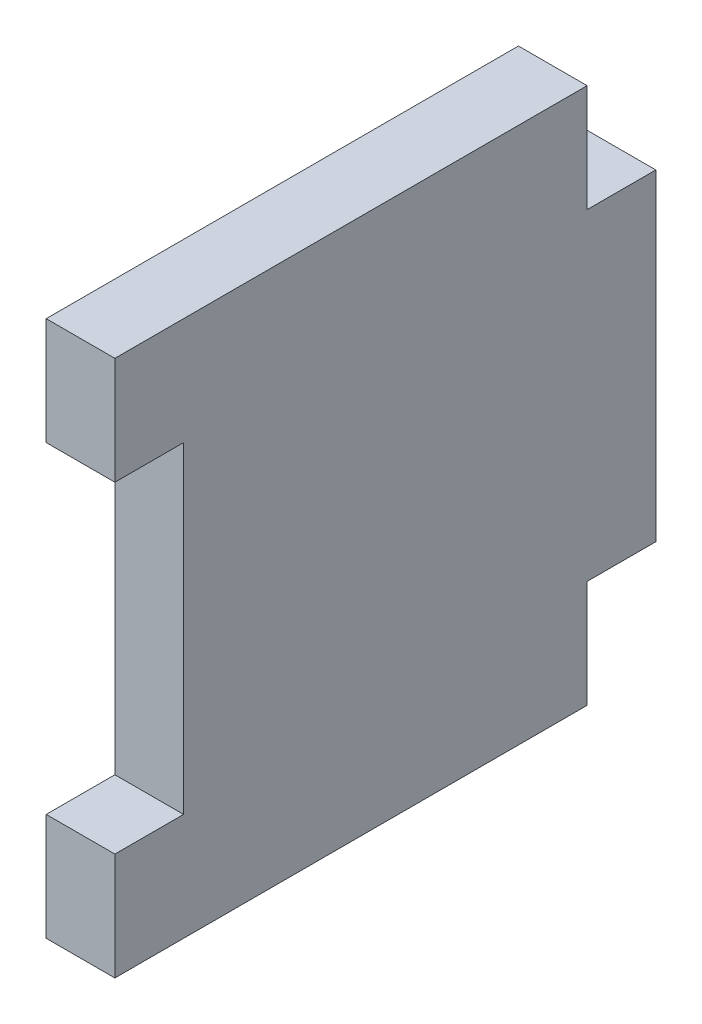
ISO-10303-21;
HEADER;
FILE_DESCRIPTION(('STEP AP214'),'2;1');
FILE_NAME('part.step','',(''),(''),'','','');
FILE_SCHEMA(('AUTOMOTIVE_DESIGN { 1 0 10303 214 1 1 1 1 }'));
ENDSEC;
DATA;
#1=APPLICATION_CONTEXT('core data for automotive mechanical design processes');
#2=APPLICATION_PROTOCOL_DEFINITION('international standard','automotive_design',2000,#1);
#3=PRODUCT_CONTEXT('',#1,'mechanical');
#4=PRODUCT('Part','Part','',(#3));
#5=PRODUCT_RELATED_PRODUCT_CATEGORY('part','',(#4));
#6=PRODUCT_DEFINITION_FORMATION('','',#4);
#7=PRODUCT_DEFINITION_CONTEXT('part definition',#1,'design');
#8=PRODUCT_DEFINITION('design','',#6,#7);
#9=PRODUCT_DEFINITION_SHAPE('','',#8);
#10=(LENGTH_UNIT() NAMED_UNIT(*) SI_UNIT(.MILLI.,.METRE.));
#11=(NAMED_UNIT(*) PLANE_ANGLE_UNIT() SI_UNIT($,.RADIAN.));
#12=(NAMED_UNIT(*) SI_UNIT($,.STERADIAN.) SOLID_ANGLE_UNIT());
#13=UNCERTAINTY_MEASURE_WITH_UNIT(LENGTH_MEASURE(1.E-05),#10,'distance_accuracy_value','');
#14=(GEOMETRIC_REPRESENTATION_CONTEXT(3) GLOBAL_UNCERTAINTY_ASSIGNED_CONTEXT((#13)) GLOBAL_UNIT_ASSIGNED_CONTEXT((#10,
#11,#12)) REPRESENTATION_CONTEXT('',''));
#15=CARTESIAN_POINT('',(0.,0.,0.));
#16=DIRECTION('',(0.,0.,1.));
#17=DIRECTION('',(1.,0.,0.));
#18=AXIS2_PLACEMENT_3D('',#15,#16,#17);
#19=CARTESIAN_POINT('',(3.2,0.,3.2));
#20=DIRECTION('',(0.,1.,0.));
#21=DIRECTION('',(0.,0.,1.));
#22=AXIS2_PLACEMENT_3D('',#19,#20,#21);
#23=PLANE('',#22);
#24=DIRECTION('',(0.,0.,-1.));
#25=VECTOR('',#24,1.);
#26=CARTESIAN_POINT('',(0.,0.,3.2));
#27=LINE('',#26,#25);
#28=CARTESIAN_POINT('',(0.,0.,3.2));
#29=VERTEX_POINT('',#28);
#30=CARTESIAN_POINT('',(0.,0.,0.));
#31=VERTEX_POINT('',#30);
#32=EDGE_CURVE('E152',#29,#31,#27,.T.);
#33=ORIENTED_EDGE('',*,*,#32,.T.);
#34=DIRECTION('',(-1.,0.,0.));
#35=VECTOR('',#34,1.);
#36=CARTESIAN_POINT('',(3.2,0.,0.));
#37=LINE('',#36,#35);
#38=CARTESIAN_POINT('',(3.2,0.,0.));
#39=VERTEX_POINT('',#38);
#40=EDGE_CURVE('E11',#39,#31,#37,.T.);
#41=ORIENTED_EDGE('',*,*,#40,.F.);
#42=DIRECTION('',(0.,0.,-1.));
#43=VECTOR('',#42,1.);
#44=CARTESIAN_POINT('',(3.2,0.,3.2));
#45=LINE('',#44,#43);
#46=CARTESIAN_POINT('',(3.2,0.,3.2));
#47=VERTEX_POINT('',#46);
#48=EDGE_CURVE('E174',#47,#39,#45,.T.);
#49=ORIENTED_EDGE('',*,*,#48,.F.);
#50=DIRECTION('',(-1.,0.,0.));
#51=VECTOR('',#50,1.);
#52=CARTESIAN_POINT('',(3.2,0.,3.2));
#53=LINE('',#52,#51);
#54=EDGE_CURVE('E148',#47,#29,#53,.T.);
#55=ORIENTED_EDGE('',*,*,#54,.T.);
#56=EDGE_LOOP('',(#33,#41,#49,#55));
#57=FACE_BOUND('',#56,.T.);
#58=ADVANCED_FACE('F32',(#57),#23,.F.);
#59=CARTESIAN_POINT('',(3.2,0.,0.));
#60=DIRECTION('',(0.,0.,1.));
#61=DIRECTION('',(1.,0.,0.));
#62=AXIS2_PLACEMENT_3D('',#59,#60,#61);
#63=PLANE('',#62);
#64=DIRECTION('',(0.,1.,0.));
#65=VECTOR('',#64,1.);
#66=CARTESIAN_POINT('',(0.,0.,0.));
#67=LINE('',#66,#65);
#68=CARTESIAN_POINT('',(0.,15.,0.));
#69=VERTEX_POINT('',#68);
#70=EDGE_CURVE('E155',#31,#69,#67,.T.);
#71=ORIENTED_EDGE('',*,*,#70,.T.);
#72=DIRECTION('',(-1.,0.,0.));
#73=VECTOR('',#72,1.);
#74=CARTESIAN_POINT('',(3.2,15.,0.));
#75=LINE('',#74,#73);
#76=CARTESIAN_POINT('',(3.2,15.,0.));
#77=VERTEX_POINT('',#76);
#78=EDGE_CURVE('E40',#77,#69,#75,.T.);
#79=ORIENTED_EDGE('',*,*,#78,.F.);
#80=DIRECTION('',(0.,1.,0.));
#81=VECTOR('',#80,1.);
#82=CARTESIAN_POINT('',(3.2,0.,0.));
#83=LINE('',#82,#81);
#84=EDGE_CURVE('E103',#39,#77,#83,.T.);
#85=ORIENTED_EDGE('',*,*,#84,.F.);
#86=ORIENTED_EDGE('',*,*,#40,.T.);
#87=EDGE_LOOP('',(#71,#79,#85,#86));
#88=FACE_BOUND('',#87,.T.);
#89=ADVANCED_FACE('F252',(#88),#63,.F.);
#90=CARTESIAN_POINT('',(3.2,15.,0.));
#91=DIRECTION('',(0.,-1.,0.));
#92=DIRECTION('',(0.,0.,-1.));
#93=AXIS2_PLACEMENT_3D('',#90,#91,#92);
#94=PLANE('',#93);
#95=DIRECTION('',(0.,0.,1.));
#96=VECTOR('',#95,1.);
#97=CARTESIAN_POINT('',(0.,15.,0.));
#98=LINE('',#97,#96);
#99=CARTESIAN_POINT('',(0.,15.,3.2));
#100=VERTEX_POINT('',#99);
#101=EDGE_CURVE('E157',#69,#100,#98,.T.);
#102=ORIENTED_EDGE('',*,*,#101,.T.);
#103=DIRECTION('',(-1.,0.,0.));
#104=VECTOR('',#103,1.);
#105=CARTESIAN_POINT('',(3.2,15.,3.2));
#106=LINE('',#105,#104);
#107=CARTESIAN_POINT('',(3.2,15.,3.2));
#108=VERTEX_POINT('',#107);
#109=EDGE_CURVE('E193',#108,#100,#106,.T.);
#110=ORIENTED_EDGE('',*,*,#109,.F.);
#111=DIRECTION('',(0.,0.,1.));
#112=VECTOR('',#111,1.);
#113=CARTESIAN_POINT('',(3.2,15.,0.));
#114=LINE('',#113,#112);
#115=EDGE_CURVE('E201',#77,#108,#114,.T.);
#116=ORIENTED_EDGE('',*,*,#115,.F.);
#117=ORIENTED_EDGE('',*,*,#78,.T.);
#118=EDGE_LOOP('',(#102,#110,#116,#117));
#119=FACE_BOUND('',#118,.T.);
#120=ADVANCED_FACE('F199',(#119),#94,.F.);
#121=CARTESIAN_POINT('',(3.2,15.,3.2));
#122=DIRECTION('',(0.,0.,1.));
#123=DIRECTION('',(1.,0.,0.));
#124=AXIS2_PLACEMENT_3D('',#121,#122,#123);
#125=PLANE('',#124);
#126=DIRECTION('',(0.,1.,0.));
#127=VECTOR('',#126,1.);
#128=CARTESIAN_POINT('',(0.,15.,3.2));
#129=LINE('',#128,#127);
#130=CARTESIAN_POINT('',(0.,20.,3.2));
#131=VERTEX_POINT('',#130);
#132=EDGE_CURVE('E159',#100,#131,#129,.T.);
#133=ORIENTED_EDGE('',*,*,#132,.T.);
#134=DIRECTION('',(-1.,0.,0.));
#135=VECTOR('',#134,1.);
#136=CARTESIAN_POINT('',(3.2,20.,3.2));
#137=LINE('',#136,#135);
#138=CARTESIAN_POINT('',(3.2,20.,3.2));
#139=VERTEX_POINT('',#138);
#140=EDGE_CURVE('E190',#139,#131,#137,.T.);
#141=ORIENTED_EDGE('',*,*,#140,.F.);
#142=DIRECTION('',(0.,1.,0.));
#143=VECTOR('',#142,1.);
#144=CARTESIAN_POINT('',(3.2,15.,3.2));
#145=LINE('',#144,#143);
#146=EDGE_CURVE('E219',#108,#139,#145,.T.);
#147=ORIENTED_EDGE('',*,*,#146,.F.);
#148=ORIENTED_EDGE('',*,*,#109,.T.);
#149=EDGE_LOOP('',(#133,#141,#147,#148));
#150=FACE_BOUND('',#149,.T.);
#151=ADVANCED_FACE('F210',(#150),#125,.F.);
#152=CARTESIAN_POINT('',(3.2,20.,3.2));
#153=DIRECTION('',(0.,-1.,0.));
#154=DIRECTION('',(0.,0.,-1.));
#155=AXIS2_PLACEMENT_3D('',#152,#153,#154);
#156=PLANE('',#155);
#157=DIRECTION('',(0.,0.,1.));
#158=VECTOR('',#157,1.);
#159=CARTESIAN_POINT('',(0.,20.,3.2));
#160=LINE('',#159,#158);
#161=CARTESIAN_POINT('',(0.,20.,25.2));
#162=VERTEX_POINT('',#161);
#163=EDGE_CURVE('E161',#131,#162,#160,.T.);
#164=ORIENTED_EDGE('',*,*,#163,.T.);
#165=DIRECTION('',(-1.,0.,0.));
#166=VECTOR('',#165,1.);
#167=CARTESIAN_POINT('',(3.2,20.,25.2));
#168=LINE('',#167,#166);
#169=CARTESIAN_POINT('',(3.2,20.,25.2));
#170=VERTEX_POINT('',#169);
#171=EDGE_CURVE('E187',#170,#162,#168,.T.);
#172=ORIENTED_EDGE('',*,*,#171,.F.);
#173=DIRECTION('',(0.,0.,1.));
#174=VECTOR('',#173,1.);
#175=CARTESIAN_POINT('',(3.2,20.,3.2));
#176=LINE('',#175,#174);
#177=EDGE_CURVE('E216',#139,#170,#176,.T.);
#178=ORIENTED_EDGE('',*,*,#177,.F.);
#179=ORIENTED_EDGE('',*,*,#140,.T.);
#180=EDGE_LOOP('',(#164,#172,#178,#179));
#181=FACE_BOUND('',#180,.T.);
#182=ADVANCED_FACE('F214',(#181),#156,.F.);
#183=CARTESIAN_POINT('',(3.2,20.,25.2));
#184=DIRECTION('',(0.,0.,-1.));
#185=DIRECTION('',(-1.,0.,0.));
#186=AXIS2_PLACEMENT_3D('',#183,#184,#185);
#187=PLANE('',#186);
#188=DIRECTION('',(0.,-1.,0.));
#189=VECTOR('',#188,1.);
#190=CARTESIAN_POINT('',(0.,20.,25.2));
#191=LINE('',#190,#189);
#192=CARTESIAN_POINT('',(0.,15.,25.2));
#193=VERTEX_POINT('',#192);
#194=EDGE_CURVE('E163',#162,#193,#191,.T.);
#195=ORIENTED_EDGE('',*,*,#194,.T.);
#196=DIRECTION('',(-1.,0.,0.));
#197=VECTOR('',#196,1.);
#198=CARTESIAN_POINT('',(3.2,15.,25.2));
#199=LINE('',#198,#197);
#200=CARTESIAN_POINT('',(3.2,15.,25.2));
#201=VERTEX_POINT('',#200);
#202=EDGE_CURVE('E184',#201,#193,#199,.T.);
#203=ORIENTED_EDGE('',*,*,#202,.F.);
#204=DIRECTION('',(0.,-1.,0.));
#205=VECTOR('',#204,1.);
#206=CARTESIAN_POINT('',(3.2,20.,25.2));
#207=LINE('',#206,#205);
#208=EDGE_CURVE('E218',#170,#201,#207,.T.);
#209=ORIENTED_EDGE('',*,*,#208,.F.);
#210=ORIENTED_EDGE('',*,*,#171,.T.);
#211=EDGE_LOOP('',(#195,#203,#209,#210));
#212=FACE_BOUND('',#211,.T.);
#213=ADVANCED_FACE('F265',(#212),#187,.F.);
#214=CARTESIAN_POINT('',(3.2,15.,25.2));
#215=DIRECTION('',(0.,1.,0.));
#216=DIRECTION('',(0.,0.,1.));
#217=AXIS2_PLACEMENT_3D('',#214,#215,#216);
#218=PLANE('',#217);
#219=DIRECTION('',(0.,0.,-1.));
#220=VECTOR('',#219,1.);
#221=CARTESIAN_POINT('',(0.,15.,25.2));
#222=LINE('',#221,#220);
#223=CARTESIAN_POINT('',(0.,15.,22.));
#224=VERTEX_POINT('',#223);
#225=EDGE_CURVE('E165',#193,#224,#222,.T.);
#226=ORIENTED_EDGE('',*,*,#225,.T.);
#227=DIRECTION('',(-1.,0.,0.));
#228=VECTOR('',#227,1.);
#229=CARTESIAN_POINT('',(3.2,15.,22.));
#230=LINE('',#229,#228);
#231=CARTESIAN_POINT('',(3.2,15.,22.));
#232=VERTEX_POINT('',#231);
#233=EDGE_CURVE('E181',#232,#224,#230,.T.);
#234=ORIENTED_EDGE('',*,*,#233,.F.);
#235=DIRECTION('',(0.,0.,-1.));
#236=VECTOR('',#235,1.);
#237=CARTESIAN_POINT('',(3.2,15.,25.2));
#238=LINE('',#237,#236);
#239=EDGE_CURVE('E221',#201,#232,#238,.T.);
#240=ORIENTED_EDGE('',*,*,#239,.F.);
#241=ORIENTED_EDGE('',*,*,#202,.T.);
#242=EDGE_LOOP('',(#226,#234,#240,#241));
#243=FACE_BOUND('',#242,.T.);
#244=ADVANCED_FACE('F268',(#243),#218,.F.);
#245=CARTESIAN_POINT('',(3.2,15.,22.));
#246=DIRECTION('',(0.,0.,-1.));
#247=DIRECTION('',(-1.,0.,0.));
#248=AXIS2_PLACEMENT_3D('',#245,#246,#247);
#249=PLANE('',#248);
#250=DIRECTION('',(0.,-1.,0.));
#251=VECTOR('',#250,1.);
#252=CARTESIAN_POINT('',(0.,15.,22.));
#253=LINE('',#252,#251);
#254=CARTESIAN_POINT('',(0.,0.,22.));
#255=VERTEX_POINT('',#254);
#256=EDGE_CURVE('E167',#224,#255,#253,.T.);
#257=ORIENTED_EDGE('',*,*,#256,.T.);
#258=DIRECTION('',(-1.,0.,0.));
#259=VECTOR('',#258,1.);
#260=CARTESIAN_POINT('',(3.2,0.,22.));
#261=LINE('',#260,#259);
#262=CARTESIAN_POINT('',(3.2,0.,22.));
#263=VERTEX_POINT('',#262);
#264=EDGE_CURVE('E178',#263,#255,#261,.T.);
#265=ORIENTED_EDGE('',*,*,#264,.F.);
#266=DIRECTION('',(0.,-1.,0.));
#267=VECTOR('',#266,1.);
#268=CARTESIAN_POINT('',(3.2,15.,22.));
#269=LINE('',#268,#267);
#270=EDGE_CURVE('E227',#232,#263,#269,.T.);
#271=ORIENTED_EDGE('',*,*,#270,.F.);
#272=ORIENTED_EDGE('',*,*,#233,.T.);
#273=EDGE_LOOP('',(#257,#265,#271,#272));
#274=FACE_BOUND('',#273,.T.);
#275=ADVANCED_FACE('F233',(#274),#249,.F.);
#276=CARTESIAN_POINT('',(3.2,0.,22.));
#277=DIRECTION('',(0.,-1.,0.));
#278=DIRECTION('',(0.,0.,-1.));
#279=AXIS2_PLACEMENT_3D('',#276,#277,#278);
#280=PLANE('',#279);
#281=DIRECTION('',(0.,0.,1.));
#282=VECTOR('',#281,1.);
#283=CARTESIAN_POINT('',(0.,0.,22.));
#284=LINE('',#283,#282);
#285=CARTESIAN_POINT('',(0.,0.,25.2));
#286=VERTEX_POINT('',#285);
#287=EDGE_CURVE('E169',#255,#286,#284,.T.);
#288=ORIENTED_EDGE('',*,*,#287,.T.);
#289=DIRECTION('',(-1.,0.,0.));
#290=VECTOR('',#289,1.);
#291=CARTESIAN_POINT('',(3.2,0.,25.2));
#292=LINE('',#291,#290);
#293=CARTESIAN_POINT('',(3.2,0.,25.2));
#294=VERTEX_POINT('',#293);
#295=EDGE_CURVE('E143',#294,#286,#292,.T.);
#296=ORIENTED_EDGE('',*,*,#295,.F.);
#297=DIRECTION('',(0.,0.,1.));
#298=VECTOR('',#297,1.);
#299=CARTESIAN_POINT('',(3.2,0.,22.));
#300=LINE('',#299,#298);
#301=EDGE_CURVE('E134',#263,#294,#300,.T.);
#302=ORIENTED_EDGE('',*,*,#301,.F.);
#303=ORIENTED_EDGE('',*,*,#264,.T.);
#304=EDGE_LOOP('',(#288,#296,#302,#303));
#305=FACE_BOUND('',#304,.T.);
#306=ADVANCED_FACE('F237',(#305),#280,.F.);
#307=CARTESIAN_POINT('',(3.2,0.,25.2));
#308=DIRECTION('',(0.,0.,-1.));
#309=DIRECTION('',(-1.,0.,0.));
#310=AXIS2_PLACEMENT_3D('',#307,#308,#309);
#311=PLANE('',#310);
#312=DIRECTION('',(0.,-1.,0.));
#313=VECTOR('',#312,1.);
#314=CARTESIAN_POINT('',(0.,0.,25.2));
#315=LINE('',#314,#313);
#316=CARTESIAN_POINT('',(0.,-5.,25.2));
#317=VERTEX_POINT('',#316);
#318=EDGE_CURVE('E142',#286,#317,#315,.T.);
#319=ORIENTED_EDGE('',*,*,#318,.T.);
#320=DIRECTION('',(-1.,0.,0.));
#321=VECTOR('',#320,1.);
#322=CARTESIAN_POINT('',(3.2,-5.,25.2));
#323=LINE('',#322,#321);
#324=CARTESIAN_POINT('',(3.2,-5.,25.2));
#325=VERTEX_POINT('',#324);
#326=EDGE_CURVE('E139',#325,#317,#323,.T.);
#327=ORIENTED_EDGE('',*,*,#326,.F.);
#328=DIRECTION('',(0.,-1.,0.));
#329=VECTOR('',#328,1.);
#330=CARTESIAN_POINT('',(3.2,0.,25.2));
#331=LINE('',#330,#329);
#332=EDGE_CURVE('E128',#294,#325,#331,.T.);
#333=ORIENTED_EDGE('',*,*,#332,.F.);
#334=ORIENTED_EDGE('',*,*,#295,.T.);
#335=EDGE_LOOP('',(#319,#327,#333,#334));
#336=FACE_BOUND('',#335,.T.);
#337=ADVANCED_FACE('F140',(#336),#311,.F.);
#338=CARTESIAN_POINT('',(3.2,-5.,25.2));
#339=DIRECTION('',(0.,1.,0.));
#340=DIRECTION('',(0.,0.,1.));
#341=AXIS2_PLACEMENT_3D('',#338,#339,#340);
#342=PLANE('',#341);
#343=DIRECTION('',(0.,0.,-1.));
#344=VECTOR('',#343,1.);
#345=CARTESIAN_POINT('',(0.,-5.,25.2));
#346=LINE('',#345,#344);
#347=CARTESIAN_POINT('',(0.,-5.,3.2));
#348=VERTEX_POINT('',#347);
#349=EDGE_CURVE('E89',#317,#348,#346,.T.);
#350=ORIENTED_EDGE('',*,*,#349,.T.);
#351=DIRECTION('',(-1.,0.,0.));
#352=VECTOR('',#351,1.);
#353=CARTESIAN_POINT('',(3.2,-5.,3.2));
#354=LINE('',#353,#352);
#355=CARTESIAN_POINT('',(3.2,-5.,3.2));
#356=VERTEX_POINT('',#355);
#357=EDGE_CURVE('E144',#356,#348,#354,.T.);
#358=ORIENTED_EDGE('',*,*,#357,.F.);
#359=DIRECTION('',(0.,0.,-1.));
#360=VECTOR('',#359,1.);
#361=CARTESIAN_POINT('',(3.2,-5.,25.2));
#362=LINE('',#361,#360);
#363=EDGE_CURVE('E132',#325,#356,#362,.T.);
#364=ORIENTED_EDGE('',*,*,#363,.F.);
#365=ORIENTED_EDGE('',*,*,#326,.T.);
#366=EDGE_LOOP('',(#350,#358,#364,#365));
#367=FACE_BOUND('',#366,.T.);
#368=ADVANCED_FACE('F146',(#367),#342,.F.);
#369=CARTESIAN_POINT('',(3.2,-5.,3.2));
#370=DIRECTION('',(0.,0.,1.));
#371=DIRECTION('',(1.,0.,0.));
#372=AXIS2_PLACEMENT_3D('',#369,#370,#371);
#373=PLANE('',#372);
#374=DIRECTION('',(0.,1.,0.));
#375=VECTOR('',#374,1.);
#376=CARTESIAN_POINT('',(0.,-5.,3.2));
#377=LINE('',#376,#375);
#378=EDGE_CURVE('E95',#348,#29,#377,.T.);
#379=ORIENTED_EDGE('',*,*,#378,.T.);
#380=ORIENTED_EDGE('',*,*,#54,.F.);
#381=DIRECTION('',(0.,1.,0.));
#382=VECTOR('',#381,1.);
#383=CARTESIAN_POINT('',(3.2,-5.,3.2));
#384=LINE('',#383,#382);
#385=EDGE_CURVE('E48',#356,#47,#384,.T.);
#386=ORIENTED_EDGE('',*,*,#385,.F.);
#387=ORIENTED_EDGE('',*,*,#357,.T.);
#388=EDGE_LOOP('',(#379,#380,#386,#387));
#389=FACE_BOUND('',#388,.T.);
#390=ADVANCED_FACE('F241',(#389),#373,.F.);
#391=CARTESIAN_POINT('',(3.2,0.,0.));
#392=DIRECTION('',(1.,0.,0.));
#393=DIRECTION('',(0.,0.,-1.));
#394=AXIS2_PLACEMENT_3D('',#391,#392,#393);
#395=PLANE('',#394);
#396=ORIENTED_EDGE('',*,*,#48,.T.);
#397=ORIENTED_EDGE('',*,*,#84,.T.);
#398=ORIENTED_EDGE('',*,*,#115,.T.);
#399=ORIENTED_EDGE('',*,*,#146,.T.);
#400=ORIENTED_EDGE('',*,*,#177,.T.);
#401=ORIENTED_EDGE('',*,*,#208,.T.);
#402=ORIENTED_EDGE('',*,*,#239,.T.);
#403=ORIENTED_EDGE('',*,*,#270,.T.);
#404=ORIENTED_EDGE('',*,*,#301,.T.);
#405=ORIENTED_EDGE('',*,*,#332,.T.);
#406=ORIENTED_EDGE('',*,*,#363,.T.);
#407=ORIENTED_EDGE('',*,*,#385,.T.);
#408=EDGE_LOOP('',(#396,#397,#398,#399,#400,#401,#402,#403,#404,#405,#406,#407));
#409=FACE_BOUND('',#408,.T.);
#410=ADVANCED_FACE('F130',(#409),#395,.T.);
#411=CARTESIAN_POINT('',(0.,0.,0.));
#412=DIRECTION('',(1.,0.,0.));
#413=DIRECTION('',(0.,0.,-1.));
#414=AXIS2_PLACEMENT_3D('',#411,#412,#413);
#415=PLANE('',#414);
#416=ORIENTED_EDGE('',*,*,#32,.F.);
#417=ORIENTED_EDGE('',*,*,#378,.F.);
#418=ORIENTED_EDGE('',*,*,#349,.F.);
#419=ORIENTED_EDGE('',*,*,#318,.F.);
#420=ORIENTED_EDGE('',*,*,#287,.F.);
#421=ORIENTED_EDGE('',*,*,#256,.F.);
#422=ORIENTED_EDGE('',*,*,#225,.F.);
#423=ORIENTED_EDGE('',*,*,#194,.F.);
#424=ORIENTED_EDGE('',*,*,#163,.F.);
#425=ORIENTED_EDGE('',*,*,#132,.F.);
#426=ORIENTED_EDGE('',*,*,#101,.F.);
#427=ORIENTED_EDGE('',*,*,#70,.F.);
#428=EDGE_LOOP('',(#416,#417,#418,#419,#420,#421,#422,#423,#424,#425,#426,#427));
#429=FACE_BOUND('',#428,.T.);
#430=ADVANCED_FACE('F205',(#429),#415,.F.);
#431=CLOSED_SHELL('',(#58,#89,#120,#151,#182,#213,#244,#275,#306,#337,#368,#390,#410,#430));
#432=MANIFOLD_SOLID_BREP('B2',#431);
#433=ADVANCED_BREP_SHAPE_REPRESENTATION('',(#18,#432),#14);
#434=SHAPE_DEFINITION_REPRESENTATION(#9,#433);
ENDSEC;
END-ISO-10303-21;
